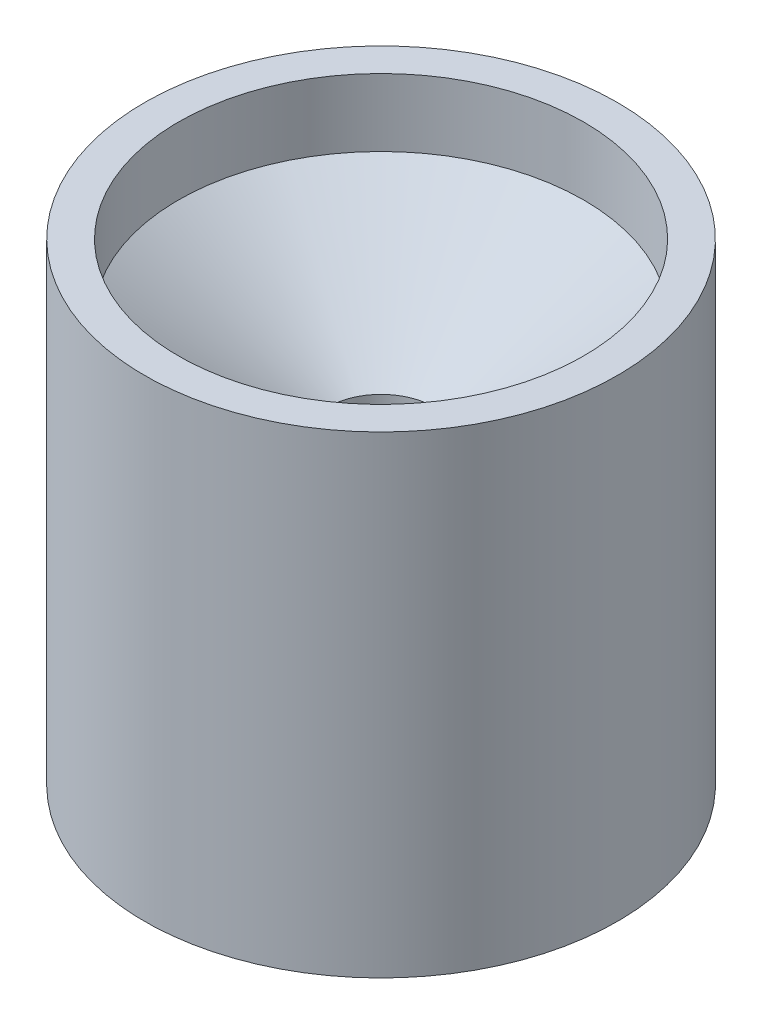
ISO-10303-21;
HEADER;
FILE_DESCRIPTION(('STEP AP214'),'2;1');
FILE_NAME('part.step','',(''),(''),'','','');
FILE_SCHEMA(('AUTOMOTIVE_DESIGN { 1 0 10303 214 1 1 1 1 }'));
ENDSEC;
DATA;
#1=APPLICATION_CONTEXT('core data for automotive mechanical design processes');
#2=APPLICATION_PROTOCOL_DEFINITION('international standard','automotive_design',2000,#1);
#3=PRODUCT_CONTEXT('',#1,'mechanical');
#4=PRODUCT('Part','Part','',(#3));
#5=PRODUCT_RELATED_PRODUCT_CATEGORY('part','',(#4));
#6=PRODUCT_DEFINITION_FORMATION('','',#4);
#7=PRODUCT_DEFINITION_CONTEXT('part definition',#1,'design');
#8=PRODUCT_DEFINITION('design','',#6,#7);
#9=PRODUCT_DEFINITION_SHAPE('','',#8);
#10=(LENGTH_UNIT() NAMED_UNIT(*) SI_UNIT(.MILLI.,.METRE.));
#11=(NAMED_UNIT(*) PLANE_ANGLE_UNIT() SI_UNIT($,.RADIAN.));
#12=(NAMED_UNIT(*) SI_UNIT($,.STERADIAN.) SOLID_ANGLE_UNIT());
#13=UNCERTAINTY_MEASURE_WITH_UNIT(LENGTH_MEASURE(1.E-05),#10,'distance_accuracy_value','');
#14=(GEOMETRIC_REPRESENTATION_CONTEXT(3) GLOBAL_UNCERTAINTY_ASSIGNED_CONTEXT((#13)) GLOBAL_UNIT_ASSIGNED_CONTEXT((#10,
#11,#12)) REPRESENTATION_CONTEXT('',''));
#15=CARTESIAN_POINT('',(0.,0.,0.));
#16=DIRECTION('',(0.,0.,1.));
#17=DIRECTION('',(1.,0.,0.));
#18=AXIS2_PLACEMENT_3D('',#15,#16,#17);
#19=CARTESIAN_POINT('',(0.,0.,0.));
#20=DIRECTION('',(0.,-1.,0.));
#21=DIRECTION('',(0.,0.,-1.));
#22=AXIS2_PLACEMENT_3D('',#19,#20,#21);
#23=CYLINDRICAL_SURFACE('',#22,38.1);
#24=CARTESIAN_POINT('',(0.,88.9,0.));
#25=DIRECTION('',(0.,-1.,0.));
#26=DIRECTION('',(0.,0.,-1.));
#27=AXIS2_PLACEMENT_3D('',#24,#25,#26);
#28=CIRCLE('',#27,38.1);
#29=CARTESIAN_POINT('',(0.,88.9,-38.1));
#30=VERTEX_POINT('',#29);
#31=EDGE_CURVE('E59',#30,#30,#28,.T.);
#32=ORIENTED_EDGE('',*,*,#31,.F.);
#33=EDGE_LOOP('',(#32));
#34=FACE_BOUND('',#33,.T.);
#35=CARTESIAN_POINT('',(0.,76.2,0.));
#36=DIRECTION('',(0.,-1.,0.));
#37=DIRECTION('',(0.,0.,-1.));
#38=AXIS2_PLACEMENT_3D('',#35,#36,#37);
#39=CIRCLE('',#38,38.1);
#40=CARTESIAN_POINT('',(0.,76.2,-38.1));
#41=VERTEX_POINT('',#40);
#42=EDGE_CURVE('E10',#41,#41,#39,.T.);
#43=ORIENTED_EDGE('',*,*,#42,.T.);
#44=EDGE_LOOP('',(#43));
#45=FACE_BOUND('',#44,.T.);
#46=ADVANCED_FACE('F34',(#34,#45),#23,.F.);
#47=CARTESIAN_POINT('',(0.,56.5294897535975,0.));
#48=DIRECTION('',(0.,1.,0.));
#49=DIRECTION('',(0.,0.,1.));
#50=AXIS2_PLACEMENT_3D('',#47,#48,#49);
#51=CONICAL_SURFACE('',#50,10.0076,0.95993108859688);
#52=ORIENTED_EDGE('',*,*,#42,.F.);
#53=EDGE_LOOP('',(#52));
#54=FACE_BOUND('',#53,.T.);
#55=CARTESIAN_POINT('',(0.,56.5294897535975,0.));
#56=DIRECTION('',(0.,-1.,0.));
#57=DIRECTION('',(0.,0.,-1.));
#58=AXIS2_PLACEMENT_3D('',#55,#56,#57);
#59=CIRCLE('',#58,10.0076);
#60=CARTESIAN_POINT('',(0.,56.5294897535975,-10.0076));
#61=VERTEX_POINT('',#60);
#62=EDGE_CURVE('E40',#61,#61,#59,.T.);
#63=ORIENTED_EDGE('',*,*,#62,.T.);
#64=EDGE_LOOP('',(#63));
#65=FACE_BOUND('',#64,.T.);
#66=ADVANCED_FACE('F66',(#54,#65),#51,.F.);
#67=CARTESIAN_POINT('',(0.,0.,0.));
#68=DIRECTION('',(0.,-1.,0.));
#69=DIRECTION('',(0.,0.,-1.));
#70=AXIS2_PLACEMENT_3D('',#67,#68,#69);
#71=CYLINDRICAL_SURFACE('',#70,10.0076);
#72=ORIENTED_EDGE('',*,*,#62,.F.);
#73=EDGE_LOOP('',(#72));
#74=FACE_BOUND('',#73,.T.);
#75=CARTESIAN_POINT('',(0.,50.1794897535975,0.));
#76=DIRECTION('',(0.,-1.,0.));
#77=DIRECTION('',(0.,0.,-1.));
#78=AXIS2_PLACEMENT_3D('',#75,#76,#77);
#79=CIRCLE('',#78,10.0076);
#80=CARTESIAN_POINT('',(0.,50.1794897535975,-10.0076));
#81=VERTEX_POINT('',#80);
#82=EDGE_CURVE('E44',#81,#81,#79,.T.);
#83=ORIENTED_EDGE('',*,*,#82,.T.);
#84=EDGE_LOOP('',(#83));
#85=FACE_BOUND('',#84,.T.);
#86=ADVANCED_FACE('F70',(#74,#85),#71,.F.);
#87=CARTESIAN_POINT('',(0.,0.,0.));
#88=DIRECTION('',(0.,-1.,0.));
#89=DIRECTION('',(0.,0.,-1.));
#90=AXIS2_PLACEMENT_3D('',#87,#88,#89);
#91=CONICAL_SURFACE('',#90,23.4531537560819,0.261799387799143);
#92=ORIENTED_EDGE('',*,*,#82,.F.);
#93=EDGE_LOOP('',(#92));
#94=FACE_BOUND('',#93,.T.);
#95=CARTESIAN_POINT('',(0.,0.,0.));
#96=DIRECTION('',(0.,-1.,0.));
#97=DIRECTION('',(0.,0.,-1.));
#98=AXIS2_PLACEMENT_3D('',#95,#96,#97);
#99=CIRCLE('',#98,23.4531537560819);
#100=CARTESIAN_POINT('',(0.,0.,-23.4531537560819));
#101=VERTEX_POINT('',#100);
#102=EDGE_CURVE('E48',#101,#101,#99,.T.);
#103=ORIENTED_EDGE('',*,*,#102,.T.);
#104=EDGE_LOOP('',(#103));
#105=FACE_BOUND('',#104,.T.);
#106=ADVANCED_FACE('F75',(#94,#105),#91,.F.);
#107=CARTESIAN_POINT('',(-23.4531537560819,0.,0.));
#108=DIRECTION('',(0.,1.,0.));
#109=DIRECTION('',(0.,0.,1.));
#110=AXIS2_PLACEMENT_3D('',#107,#108,#109);
#111=PLANE('',#110);
#112=ORIENTED_EDGE('',*,*,#102,.F.);
#113=EDGE_LOOP('',(#112));
#114=FACE_BOUND('',#113,.T.);
#115=CARTESIAN_POINT('',(0.,0.,0.));
#116=DIRECTION('',(0.,-1.,0.));
#117=DIRECTION('',(0.,0.,-1.));
#118=AXIS2_PLACEMENT_3D('',#115,#116,#117);
#119=CIRCLE('',#118,44.45);
#120=CARTESIAN_POINT('',(0.,0.,-44.45));
#121=VERTEX_POINT('',#120);
#122=EDGE_CURVE('E53',#121,#121,#119,.T.);
#123=ORIENTED_EDGE('',*,*,#122,.T.);
#124=EDGE_LOOP('',(#123));
#125=FACE_BOUND('',#124,.T.);
#126=ADVANCED_FACE('F81',(#114,#125),#111,.F.);
#127=CARTESIAN_POINT('',(0.,0.,0.));
#128=DIRECTION('',(0.,-1.,0.));
#129=DIRECTION('',(0.,0.,-1.));
#130=AXIS2_PLACEMENT_3D('',#127,#128,#129);
#131=CYLINDRICAL_SURFACE('',#130,44.45);
#132=ORIENTED_EDGE('',*,*,#122,.F.);
#133=EDGE_LOOP('',(#132));
#134=FACE_BOUND('',#133,.T.);
#135=CARTESIAN_POINT('',(0.,88.9,0.));
#136=DIRECTION('',(0.,-1.,0.));
#137=DIRECTION('',(0.,0.,-1.));
#138=AXIS2_PLACEMENT_3D('',#135,#136,#137);
#139=CIRCLE('',#138,44.45);
#140=CARTESIAN_POINT('',(0.,88.9,-44.45));
#141=VERTEX_POINT('',#140);
#142=EDGE_CURVE('E56',#141,#141,#139,.T.);
#143=ORIENTED_EDGE('',*,*,#142,.T.);
#144=EDGE_LOOP('',(#143));
#145=FACE_BOUND('',#144,.T.);
#146=ADVANCED_FACE('F85',(#134,#145),#131,.T.);
#147=CARTESIAN_POINT('',(-44.45,88.9,0.));
#148=DIRECTION('',(0.,-1.,0.));
#149=DIRECTION('',(0.,0.,-1.));
#150=AXIS2_PLACEMENT_3D('',#147,#148,#149);
#151=PLANE('',#150);
#152=ORIENTED_EDGE('',*,*,#142,.F.);
#153=EDGE_LOOP('',(#152));
#154=FACE_BOUND('',#153,.T.);
#155=ORIENTED_EDGE('',*,*,#31,.T.);
#156=EDGE_LOOP('',(#155));
#157=FACE_BOUND('',#156,.T.);
#158=ADVANCED_FACE('F63',(#154,#157),#151,.F.);
#159=CLOSED_SHELL('',(#46,#66,#86,#106,#126,#146,#158));
#160=MANIFOLD_SOLID_BREP('B2',#159);
#161=ADVANCED_BREP_SHAPE_REPRESENTATION('',(#18,#160),#14);
#162=SHAPE_DEFINITION_REPRESENTATION(#9,#161);
ENDSEC;
END-ISO-10303-21;
